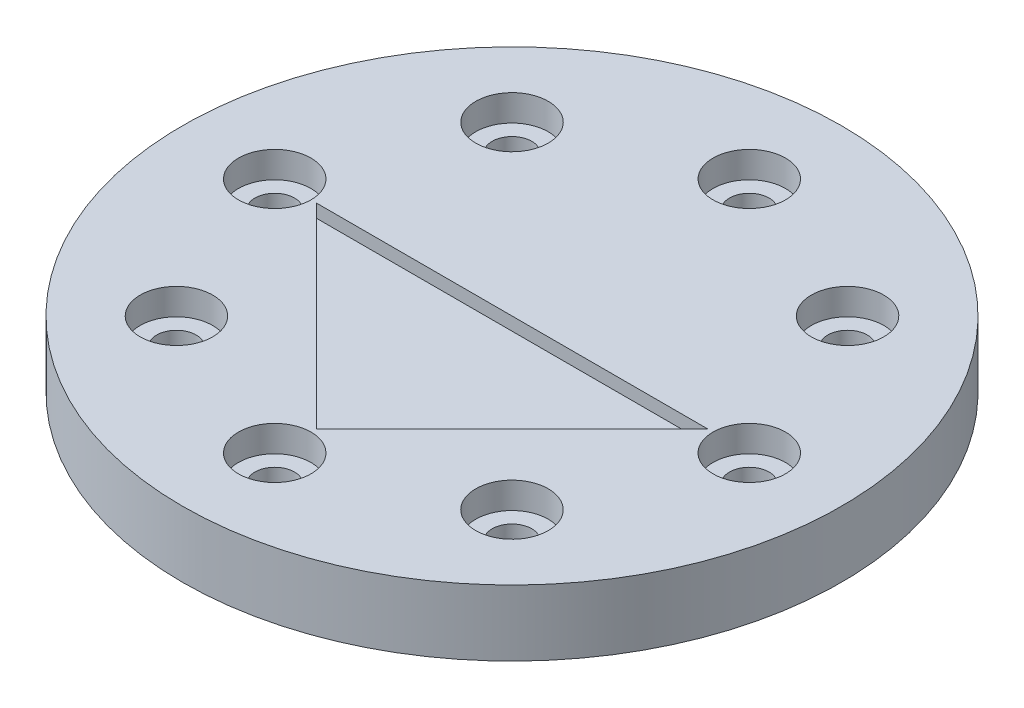
ISO-10303-21;
HEADER;
FILE_DESCRIPTION(('STEP AP214'),'2;1');
FILE_NAME('part.step','',(''),(''),'','','');
FILE_SCHEMA(('AUTOMOTIVE_DESIGN { 1 0 10303 214 1 1 1 1 }'));
ENDSEC;
DATA;
#1=APPLICATION_CONTEXT('core data for automotive mechanical design processes');
#2=APPLICATION_PROTOCOL_DEFINITION('international standard','automotive_design',2000,#1);
#3=PRODUCT_CONTEXT('',#1,'mechanical');
#4=PRODUCT('Part','Part','',(#3));
#5=PRODUCT_RELATED_PRODUCT_CATEGORY('part','',(#4));
#6=PRODUCT_DEFINITION_FORMATION('','',#4);
#7=PRODUCT_DEFINITION_CONTEXT('part definition',#1,'design');
#8=PRODUCT_DEFINITION('design','',#6,#7);
#9=PRODUCT_DEFINITION_SHAPE('','',#8);
#10=(LENGTH_UNIT() NAMED_UNIT(*) SI_UNIT(.MILLI.,.METRE.));
#11=(NAMED_UNIT(*) PLANE_ANGLE_UNIT() SI_UNIT($,.RADIAN.));
#12=(NAMED_UNIT(*) SI_UNIT($,.STERADIAN.) SOLID_ANGLE_UNIT());
#13=UNCERTAINTY_MEASURE_WITH_UNIT(LENGTH_MEASURE(1.E-05),#10,'distance_accuracy_value','');
#14=(GEOMETRIC_REPRESENTATION_CONTEXT(3) GLOBAL_UNCERTAINTY_ASSIGNED_CONTEXT((#13)) GLOBAL_UNIT_ASSIGNED_CONTEXT((#10,
#11,#12)) REPRESENTATION_CONTEXT('',''));
#15=CARTESIAN_POINT('',(0.,0.,0.));
#16=DIRECTION('',(0.,0.,1.));
#17=DIRECTION('',(1.,0.,0.));
#18=AXIS2_PLACEMENT_3D('',#15,#16,#17);
#19=CARTESIAN_POINT('',(0.,3.,0.));
#20=DIRECTION('',(0.,1.,0.));
#21=DIRECTION('',(0.,0.,1.));
#22=AXIS2_PLACEMENT_3D('',#19,#20,#21);
#23=PLANE('',#22);
#24=CARTESIAN_POINT('',(1.88539992297529E-13,3.,-18.));
#25=DIRECTION('',(0.,1.,0.));
#26=DIRECTION('',(1.,0.,0.));
#27=AXIS2_PLACEMENT_3D('',#24,#25,#26);
#28=CIRCLE('',#27,2.75);
#29=CARTESIAN_POINT('',(2.75000000000019,3.,-18.));
#30=VERTEX_POINT('',#29);
#31=EDGE_CURVE('E179',#30,#30,#28,.T.);
#32=ORIENTED_EDGE('',*,*,#31,.F.);
#33=EDGE_LOOP('',(#32));
#34=FACE_BOUND('',#33,.T.);
#35=CARTESIAN_POINT('',(-18.,3.,0.));
#36=DIRECTION('',(0.,1.,0.));
#37=DIRECTION('',(0.,0.,-1.));
#38=AXIS2_PLACEMENT_3D('',#35,#36,#37);
#39=CIRCLE('',#38,2.75);
#40=CARTESIAN_POINT('',(-18.,3.,-2.75));
#41=VERTEX_POINT('',#40);
#42=EDGE_CURVE('E161',#41,#41,#39,.T.);
#43=ORIENTED_EDGE('',*,*,#42,.F.);
#44=EDGE_LOOP('',(#43));
#45=FACE_BOUND('',#44,.T.);
#46=CARTESIAN_POINT('',(0.,3.,18.));
#47=DIRECTION('',(0.,1.,0.));
#48=DIRECTION('',(-1.,0.,0.));
#49=AXIS2_PLACEMENT_3D('',#46,#47,#48);
#50=CIRCLE('',#49,2.75);
#51=CARTESIAN_POINT('',(-2.75000000000006,3.,18.));
#52=VERTEX_POINT('',#51);
#53=EDGE_CURVE('E143',#52,#52,#50,.T.);
#54=ORIENTED_EDGE('',*,*,#53,.F.);
#55=EDGE_LOOP('',(#54));
#56=FACE_BOUND('',#55,.T.);
#57=CARTESIAN_POINT('',(18.,3.,0.));
#58=DIRECTION('',(0.,1.,0.));
#59=DIRECTION('',(0.,0.,1.));
#60=AXIS2_PLACEMENT_3D('',#57,#58,#59);
#61=CIRCLE('',#60,2.75);
#62=CARTESIAN_POINT('',(18.,3.,2.75));
#63=VERTEX_POINT('',#62);
#64=EDGE_CURVE('E125',#63,#63,#61,.T.);
#65=ORIENTED_EDGE('',*,*,#64,.F.);
#66=EDGE_LOOP('',(#65));
#67=FACE_BOUND('',#66,.T.);
#68=CARTESIAN_POINT('',(0.,3.,0.));
#69=DIRECTION('',(0.,1.,0.));
#70=DIRECTION('',(0.,0.,1.));
#71=AXIS2_PLACEMENT_3D('',#68,#69,#70);
#72=CIRCLE('',#71,25.);
#73=CARTESIAN_POINT('',(0.,3.,25.));
#74=VERTEX_POINT('',#73);
#75=EDGE_CURVE('E114',#74,#74,#72,.T.);
#76=ORIENTED_EDGE('',*,*,#75,.T.);
#77=EDGE_LOOP('',(#76));
#78=FACE_BOUND('',#77,.T.);
#79=DIRECTION('',(0.707106781186546,0.,-0.707106781186549));
#80=VECTOR('',#79,1.);
#81=CARTESIAN_POINT('',(14.8492424049176,3.,0.));
#82=LINE('',#81,#80);
#83=CARTESIAN_POINT('',(0.,3.,14.8492424049177));
#84=VERTEX_POINT('',#83);
#85=CARTESIAN_POINT('',(14.8492424049176,3.,0.));
#86=VERTEX_POINT('',#85);
#87=EDGE_CURVE('E119',#84,#86,#82,.T.);
#88=ORIENTED_EDGE('',*,*,#87,.F.);
#89=DIRECTION('',(0.707106781186546,0.,0.707106781186549));
#90=VECTOR('',#89,1.);
#91=CARTESIAN_POINT('',(0.,3.,14.8492424049177));
#92=LINE('',#91,#90);
#93=CARTESIAN_POINT('',(-14.8492424049176,3.,0.));
#94=VERTEX_POINT('',#93);
#95=EDGE_CURVE('E84',#94,#84,#92,.T.);
#96=ORIENTED_EDGE('',*,*,#95,.F.);
#97=DIRECTION('',(-1.,0.,0.));
#98=VECTOR('',#97,1.);
#99=CARTESIAN_POINT('',(-14.8492424049176,3.,0.));
#100=LINE('',#99,#98);
#101=EDGE_CURVE('E117',#86,#94,#100,.T.);
#102=ORIENTED_EDGE('',*,*,#101,.F.);
#103=EDGE_LOOP('',(#88,#96,#102));
#104=FACE_BOUND('',#103,.T.);
#105=CARTESIAN_POINT('',(12.7279220613578,3.,12.7279220613579));
#106=DIRECTION('',(0.,1.,0.));
#107=DIRECTION('',(-0.707106781186549,0.,0.707106781186546));
#108=AXIS2_PLACEMENT_3D('',#105,#106,#107);
#109=CIRCLE('',#108,2.75);
#110=CARTESIAN_POINT('',(10.7833784130948,3.,14.6724657096209));
#111=VERTEX_POINT('',#110);
#112=EDGE_CURVE('E134',#111,#111,#109,.T.);
#113=ORIENTED_EDGE('',*,*,#112,.F.);
#114=EDGE_LOOP('',(#113));
#115=FACE_BOUND('',#114,.T.);
#116=CARTESIAN_POINT('',(-12.7279220613579,3.,12.7279220613578));
#117=DIRECTION('',(0.,1.,0.));
#118=DIRECTION('',(-0.707106781186544,0.,-0.707106781186551));
#119=AXIS2_PLACEMENT_3D('',#116,#117,#118);
#120=CIRCLE('',#119,2.75);
#121=CARTESIAN_POINT('',(-14.6724657096209,3.,10.7833784130948));
#122=VERTEX_POINT('',#121);
#123=EDGE_CURVE('E152',#122,#122,#120,.T.);
#124=ORIENTED_EDGE('',*,*,#123,.F.);
#125=EDGE_LOOP('',(#124));
#126=FACE_BOUND('',#125,.T.);
#127=CARTESIAN_POINT('',(-12.7279220613577,3.,-12.727922061358));
#128=DIRECTION('',(0.,1.,0.));
#129=DIRECTION('',(0.707106781186554,0.,-0.707106781186541));
#130=AXIS2_PLACEMENT_3D('',#127,#128,#129);
#131=CIRCLE('',#130,2.75);
#132=CARTESIAN_POINT('',(-10.7833784130947,3.,-14.672465709621));
#133=VERTEX_POINT('',#132);
#134=EDGE_CURVE('E170',#133,#133,#131,.T.);
#135=ORIENTED_EDGE('',*,*,#134,.F.);
#136=EDGE_LOOP('',(#135));
#137=FACE_BOUND('',#136,.T.);
#138=CARTESIAN_POINT('',(12.727922061358,3.,-12.7279220613577));
#139=DIRECTION('',(0.,1.,0.));
#140=DIRECTION('',(0.707106781186539,0.,0.707106781186556));
#141=AXIS2_PLACEMENT_3D('',#138,#139,#140);
#142=CIRCLE('',#141,2.75);
#143=CARTESIAN_POINT('',(14.672465709621,3.,-10.7833784130947));
#144=VERTEX_POINT('',#143);
#145=EDGE_CURVE('E188',#144,#144,#142,.T.);
#146=ORIENTED_EDGE('',*,*,#145,.F.);
#147=EDGE_LOOP('',(#146));
#148=FACE_BOUND('',#147,.T.);
#149=ADVANCED_FACE('F37',(#34,#45,#56,#67,#78,#104,#115,#126,#137,#148),#23,.T.);
#150=CARTESIAN_POINT('',(0.,1.,0.));
#151=DIRECTION('',(0.,-1.,0.));
#152=DIRECTION('',(0.,0.,-1.));
#153=AXIS2_PLACEMENT_3D('',#150,#151,#152);
#154=CYLINDRICAL_SURFACE('',#153,25.);
#155=CARTESIAN_POINT('',(0.,-2.,0.));
#156=DIRECTION('',(0.,-1.,0.));
#157=DIRECTION('',(0.,0.,-1.));
#158=AXIS2_PLACEMENT_3D('',#155,#156,#157);
#159=CIRCLE('',#158,25.);
#160=CARTESIAN_POINT('',(0.,-2.,-25.));
#161=VERTEX_POINT('',#160);
#162=EDGE_CURVE('E86',#161,#161,#159,.T.);
#163=ORIENTED_EDGE('',*,*,#162,.F.);
#164=EDGE_LOOP('',(#163));
#165=FACE_BOUND('',#164,.T.);
#166=ORIENTED_EDGE('',*,*,#75,.F.);
#167=EDGE_LOOP('',(#166));
#168=FACE_BOUND('',#167,.T.);
#169=ADVANCED_FACE('F39',(#165,#168),#154,.T.);
#170=CARTESIAN_POINT('',(18.,0.,0.));
#171=DIRECTION('',(0.,1.,0.));
#172=DIRECTION('',(0.,0.,1.));
#173=AXIS2_PLACEMENT_3D('',#170,#171,#172);
#174=CYLINDRICAL_SURFACE('',#173,1.5);
#175=CARTESIAN_POINT('',(18.,1.,0.));
#176=DIRECTION('',(0.,1.,0.));
#177=DIRECTION('',(0.,0.,1.));
#178=AXIS2_PLACEMENT_3D('',#175,#176,#177);
#179=CIRCLE('',#178,1.5);
#180=CARTESIAN_POINT('',(18.,1.,1.5));
#181=VERTEX_POINT('',#180);
#182=EDGE_CURVE('E122',#181,#181,#179,.F.);
#183=ORIENTED_EDGE('',*,*,#182,.F.);
#184=EDGE_LOOP('',(#183));
#185=FACE_BOUND('',#184,.T.);
#186=CARTESIAN_POINT('',(18.,-2.,0.));
#187=DIRECTION('',(0.,1.,0.));
#188=DIRECTION('',(0.,0.,1.));
#189=AXIS2_PLACEMENT_3D('',#186,#187,#188);
#190=CIRCLE('',#189,1.5);
#191=CARTESIAN_POINT('',(18.,-2.,1.5));
#192=VERTEX_POINT('',#191);
#193=EDGE_CURVE('E90',#192,#192,#190,.T.);
#194=ORIENTED_EDGE('',*,*,#193,.F.);
#195=EDGE_LOOP('',(#194));
#196=FACE_BOUND('',#195,.T.);
#197=ADVANCED_FACE('F205',(#185,#196),#174,.F.);
#198=CARTESIAN_POINT('',(12.7279220613578,0.,12.7279220613579));
#199=DIRECTION('',(0.,1.,0.));
#200=DIRECTION('',(0.,0.,1.));
#201=AXIS2_PLACEMENT_3D('',#198,#199,#200);
#202=CYLINDRICAL_SURFACE('',#201,1.5);
#203=CARTESIAN_POINT('',(12.7279220613578,1.,12.7279220613579));
#204=DIRECTION('',(0.,1.,0.));
#205=DIRECTION('',(0.,0.,1.));
#206=AXIS2_PLACEMENT_3D('',#203,#204,#205);
#207=CIRCLE('',#206,1.5);
#208=CARTESIAN_POINT('',(12.7279220613578,1.,14.2279220613579));
#209=VERTEX_POINT('',#208);
#210=EDGE_CURVE('E129',#209,#209,#207,.F.);
#211=ORIENTED_EDGE('',*,*,#210,.F.);
#212=EDGE_LOOP('',(#211));
#213=FACE_BOUND('',#212,.T.);
#214=CARTESIAN_POINT('',(12.7279220613578,-2.,12.7279220613579));
#215=DIRECTION('',(0.,1.,0.));
#216=DIRECTION('',(-0.707106781186549,0.,0.707106781186546));
#217=AXIS2_PLACEMENT_3D('',#214,#215,#216);
#218=CIRCLE('',#217,1.5);
#219=CARTESIAN_POINT('',(11.667261889578,-2.,13.7885822331377));
#220=VERTEX_POINT('',#219);
#221=EDGE_CURVE('E93',#220,#220,#218,.T.);
#222=ORIENTED_EDGE('',*,*,#221,.F.);
#223=EDGE_LOOP('',(#222));
#224=FACE_BOUND('',#223,.T.);
#225=ADVANCED_FACE('F248',(#213,#224),#202,.F.);
#226=CARTESIAN_POINT('',(0.,0.,18.));
#227=DIRECTION('',(0.,1.,0.));
#228=DIRECTION('',(0.,0.,1.));
#229=AXIS2_PLACEMENT_3D('',#226,#227,#228);
#230=CYLINDRICAL_SURFACE('',#229,1.5);
#231=CARTESIAN_POINT('',(0.,1.,18.));
#232=DIRECTION('',(0.,1.,0.));
#233=DIRECTION('',(0.,0.,1.));
#234=AXIS2_PLACEMENT_3D('',#231,#232,#233);
#235=CIRCLE('',#234,1.5);
#236=CARTESIAN_POINT('',(0.,1.,19.5));
#237=VERTEX_POINT('',#236);
#238=EDGE_CURVE('E138',#237,#237,#235,.F.);
#239=ORIENTED_EDGE('',*,*,#238,.F.);
#240=EDGE_LOOP('',(#239));
#241=FACE_BOUND('',#240,.T.);
#242=CARTESIAN_POINT('',(0.,-2.,18.));
#243=DIRECTION('',(0.,1.,0.));
#244=DIRECTION('',(-1.,0.,0.));
#245=AXIS2_PLACEMENT_3D('',#242,#243,#244);
#246=CIRCLE('',#245,1.5);
#247=CARTESIAN_POINT('',(-1.50000000000006,-2.,18.));
#248=VERTEX_POINT('',#247);
#249=EDGE_CURVE('E96',#248,#248,#246,.T.);
#250=ORIENTED_EDGE('',*,*,#249,.F.);
#251=EDGE_LOOP('',(#250));
#252=FACE_BOUND('',#251,.T.);
#253=ADVANCED_FACE('F244',(#241,#252),#230,.F.);
#254=CARTESIAN_POINT('',(-12.7279220613579,0.,12.7279220613578));
#255=DIRECTION('',(0.,1.,0.));
#256=DIRECTION('',(0.,0.,1.));
#257=AXIS2_PLACEMENT_3D('',#254,#255,#256);
#258=CYLINDRICAL_SURFACE('',#257,1.5);
#259=CARTESIAN_POINT('',(-12.7279220613579,1.,12.7279220613578));
#260=DIRECTION('',(0.,1.,0.));
#261=DIRECTION('',(0.,0.,1.));
#262=AXIS2_PLACEMENT_3D('',#259,#260,#261);
#263=CIRCLE('',#262,1.5);
#264=CARTESIAN_POINT('',(-12.7279220613579,1.,14.2279220613578));
#265=VERTEX_POINT('',#264);
#266=EDGE_CURVE('E147',#265,#265,#263,.F.);
#267=ORIENTED_EDGE('',*,*,#266,.F.);
#268=EDGE_LOOP('',(#267));
#269=FACE_BOUND('',#268,.T.);
#270=CARTESIAN_POINT('',(-12.7279220613579,-2.,12.7279220613578));
#271=DIRECTION('',(0.,1.,0.));
#272=DIRECTION('',(-0.707106781186544,0.,-0.707106781186551));
#273=AXIS2_PLACEMENT_3D('',#270,#271,#272);
#274=CIRCLE('',#273,1.5);
#275=CARTESIAN_POINT('',(-13.7885822331377,-2.,11.667261889578));
#276=VERTEX_POINT('',#275);
#277=EDGE_CURVE('E99',#276,#276,#274,.T.);
#278=ORIENTED_EDGE('',*,*,#277,.F.);
#279=EDGE_LOOP('',(#278));
#280=FACE_BOUND('',#279,.T.);
#281=ADVANCED_FACE('F240',(#269,#280),#258,.F.);
#282=CARTESIAN_POINT('',(-18.,0.,0.));
#283=DIRECTION('',(0.,1.,0.));
#284=DIRECTION('',(0.,0.,1.));
#285=AXIS2_PLACEMENT_3D('',#282,#283,#284);
#286=CYLINDRICAL_SURFACE('',#285,1.5);
#287=CARTESIAN_POINT('',(-18.,1.,0.));
#288=DIRECTION('',(0.,1.,0.));
#289=DIRECTION('',(0.,0.,1.));
#290=AXIS2_PLACEMENT_3D('',#287,#288,#289);
#291=CIRCLE('',#290,1.5);
#292=CARTESIAN_POINT('',(-18.,1.,1.5));
#293=VERTEX_POINT('',#292);
#294=EDGE_CURVE('E156',#293,#293,#291,.F.);
#295=ORIENTED_EDGE('',*,*,#294,.F.);
#296=EDGE_LOOP('',(#295));
#297=FACE_BOUND('',#296,.T.);
#298=CARTESIAN_POINT('',(-18.,-2.,0.));
#299=DIRECTION('',(0.,1.,0.));
#300=DIRECTION('',(0.,0.,-1.));
#301=AXIS2_PLACEMENT_3D('',#298,#299,#300);
#302=CIRCLE('',#301,1.5);
#303=CARTESIAN_POINT('',(-18.,-2.,-1.5));
#304=VERTEX_POINT('',#303);
#305=EDGE_CURVE('E102',#304,#304,#302,.T.);
#306=ORIENTED_EDGE('',*,*,#305,.F.);
#307=EDGE_LOOP('',(#306));
#308=FACE_BOUND('',#307,.T.);
#309=ADVANCED_FACE('F236',(#297,#308),#286,.F.);
#310=CARTESIAN_POINT('',(-12.7279220613577,0.,-12.727922061358));
#311=DIRECTION('',(0.,1.,0.));
#312=DIRECTION('',(0.,0.,1.));
#313=AXIS2_PLACEMENT_3D('',#310,#311,#312);
#314=CYLINDRICAL_SURFACE('',#313,1.5);
#315=CARTESIAN_POINT('',(-12.7279220613577,1.,-12.727922061358));
#316=DIRECTION('',(0.,1.,0.));
#317=DIRECTION('',(0.,0.,1.));
#318=AXIS2_PLACEMENT_3D('',#315,#316,#317);
#319=CIRCLE('',#318,1.5);
#320=CARTESIAN_POINT('',(-12.7279220613577,1.,-11.227922061358));
#321=VERTEX_POINT('',#320);
#322=EDGE_CURVE('E165',#321,#321,#319,.F.);
#323=ORIENTED_EDGE('',*,*,#322,.F.);
#324=EDGE_LOOP('',(#323));
#325=FACE_BOUND('',#324,.T.);
#326=CARTESIAN_POINT('',(-12.7279220613577,-2.,-12.727922061358));
#327=DIRECTION('',(0.,1.,0.));
#328=DIRECTION('',(0.707106781186554,0.,-0.707106781186541));
#329=AXIS2_PLACEMENT_3D('',#326,#327,#328);
#330=CIRCLE('',#329,1.5);
#331=CARTESIAN_POINT('',(-11.6672618895779,-2.,-13.7885822331378));
#332=VERTEX_POINT('',#331);
#333=EDGE_CURVE('E105',#332,#332,#330,.T.);
#334=ORIENTED_EDGE('',*,*,#333,.F.);
#335=EDGE_LOOP('',(#334));
#336=FACE_BOUND('',#335,.T.);
#337=ADVANCED_FACE('F232',(#325,#336),#314,.F.);
#338=CARTESIAN_POINT('',(1.88539992297529E-13,0.,-18.));
#339=DIRECTION('',(0.,1.,0.));
#340=DIRECTION('',(0.,0.,1.));
#341=AXIS2_PLACEMENT_3D('',#338,#339,#340);
#342=CYLINDRICAL_SURFACE('',#341,1.5);
#343=CARTESIAN_POINT('',(1.88539992297529E-13,1.,-18.));
#344=DIRECTION('',(0.,1.,0.));
#345=DIRECTION('',(0.,0.,1.));
#346=AXIS2_PLACEMENT_3D('',#343,#344,#345);
#347=CIRCLE('',#346,1.5);
#348=CARTESIAN_POINT('',(1.88539992297529E-13,1.,-16.5));
#349=VERTEX_POINT('',#348);
#350=EDGE_CURVE('E174',#349,#349,#347,.F.);
#351=ORIENTED_EDGE('',*,*,#350,.F.);
#352=EDGE_LOOP('',(#351));
#353=FACE_BOUND('',#352,.T.);
#354=CARTESIAN_POINT('',(1.88539992297529E-13,-2.,-18.));
#355=DIRECTION('',(0.,1.,0.));
#356=DIRECTION('',(1.,0.,0.));
#357=AXIS2_PLACEMENT_3D('',#354,#355,#356);
#358=CIRCLE('',#357,1.5);
#359=CARTESIAN_POINT('',(1.50000000000019,-2.,-18.));
#360=VERTEX_POINT('',#359);
#361=EDGE_CURVE('E108',#360,#360,#358,.T.);
#362=ORIENTED_EDGE('',*,*,#361,.F.);
#363=EDGE_LOOP('',(#362));
#364=FACE_BOUND('',#363,.T.);
#365=ADVANCED_FACE('F228',(#353,#364),#342,.F.);
#366=CARTESIAN_POINT('',(12.727922061358,0.,-12.7279220613577));
#367=DIRECTION('',(0.,1.,0.));
#368=DIRECTION('',(0.,0.,1.));
#369=AXIS2_PLACEMENT_3D('',#366,#367,#368);
#370=CYLINDRICAL_SURFACE('',#369,1.5);
#371=CARTESIAN_POINT('',(12.727922061358,1.,-12.7279220613577));
#372=DIRECTION('',(0.,1.,0.));
#373=DIRECTION('',(0.,0.,1.));
#374=AXIS2_PLACEMENT_3D('',#371,#372,#373);
#375=CIRCLE('',#374,1.5);
#376=CARTESIAN_POINT('',(12.727922061358,1.,-11.2279220613577));
#377=VERTEX_POINT('',#376);
#378=EDGE_CURVE('E183',#377,#377,#375,.F.);
#379=ORIENTED_EDGE('',*,*,#378,.F.);
#380=EDGE_LOOP('',(#379));
#381=FACE_BOUND('',#380,.T.);
#382=CARTESIAN_POINT('',(12.727922061358,-2.,-12.7279220613577));
#383=DIRECTION('',(0.,1.,0.));
#384=DIRECTION('',(0.707106781186539,0.,0.707106781186556));
#385=AXIS2_PLACEMENT_3D('',#382,#383,#384);
#386=CIRCLE('',#385,1.5);
#387=CARTESIAN_POINT('',(13.7885822331378,-2.,-11.6672618895779));
#388=VERTEX_POINT('',#387);
#389=EDGE_CURVE('E111',#388,#388,#386,.T.);
#390=ORIENTED_EDGE('',*,*,#389,.F.);
#391=EDGE_LOOP('',(#390));
#392=FACE_BOUND('',#391,.T.);
#393=ADVANCED_FACE('F216',(#381,#392),#370,.F.);
#394=CARTESIAN_POINT('',(0.,-2.,0.));
#395=DIRECTION('',(0.,-1.,0.));
#396=DIRECTION('',(0.,0.,-1.));
#397=AXIS2_PLACEMENT_3D('',#394,#395,#396);
#398=PLANE('',#397);
#399=ORIENTED_EDGE('',*,*,#389,.T.);
#400=EDGE_LOOP('',(#399));
#401=FACE_BOUND('',#400,.T.);
#402=ORIENTED_EDGE('',*,*,#361,.T.);
#403=EDGE_LOOP('',(#402));
#404=FACE_BOUND('',#403,.T.);
#405=ORIENTED_EDGE('',*,*,#333,.T.);
#406=EDGE_LOOP('',(#405));
#407=FACE_BOUND('',#406,.T.);
#408=ORIENTED_EDGE('',*,*,#305,.T.);
#409=EDGE_LOOP('',(#408));
#410=FACE_BOUND('',#409,.T.);
#411=ORIENTED_EDGE('',*,*,#277,.T.);
#412=EDGE_LOOP('',(#411));
#413=FACE_BOUND('',#412,.T.);
#414=ORIENTED_EDGE('',*,*,#249,.T.);
#415=EDGE_LOOP('',(#414));
#416=FACE_BOUND('',#415,.T.);
#417=ORIENTED_EDGE('',*,*,#221,.T.);
#418=EDGE_LOOP('',(#417));
#419=FACE_BOUND('',#418,.T.);
#420=ORIENTED_EDGE('',*,*,#193,.T.);
#421=EDGE_LOOP('',(#420));
#422=FACE_BOUND('',#421,.T.);
#423=ORIENTED_EDGE('',*,*,#162,.T.);
#424=EDGE_LOOP('',(#423));
#425=FACE_BOUND('',#424,.T.);
#426=ADVANCED_FACE('F213',(#401,#404,#407,#410,#413,#416,#419,#422,#425),#398,.T.);
#427=CARTESIAN_POINT('',(0.,0.,14.8492424049177));
#428=DIRECTION('',(-0.707106781186549,0.,-0.707106781186546));
#429=DIRECTION('',(-0.707106781186546,0.,0.707106781186549));
#430=AXIS2_PLACEMENT_3D('',#427,#428,#429);
#431=PLANE('',#430);
#432=DIRECTION('',(0.707106781186546,0.,-0.707106781186549));
#433=VECTOR('',#432,1.);
#434=CARTESIAN_POINT('',(14.8492424049176,2.,0.));
#435=LINE('',#434,#433);
#436=CARTESIAN_POINT('',(0.,2.,14.8492424049177));
#437=VERTEX_POINT('',#436);
#438=CARTESIAN_POINT('',(14.8492424049176,2.,0.));
#439=VERTEX_POINT('',#438);
#440=EDGE_CURVE('E54',#437,#439,#435,.T.);
#441=ORIENTED_EDGE('',*,*,#440,.F.);
#442=DIRECTION('',(0.,1.,0.));
#443=VECTOR('',#442,1.);
#444=CARTESIAN_POINT('',(0.,0.,14.8492424049177));
#445=LINE('',#444,#443);
#446=EDGE_CURVE('E46',#437,#84,#445,.T.);
#447=ORIENTED_EDGE('',*,*,#446,.T.);
#448=ORIENTED_EDGE('',*,*,#87,.T.);
#449=DIRECTION('',(0.,1.,0.));
#450=VECTOR('',#449,1.);
#451=CARTESIAN_POINT('',(14.8492424049176,0.,0.));
#452=LINE('',#451,#450);
#453=EDGE_CURVE('E41',#439,#86,#452,.T.);
#454=ORIENTED_EDGE('',*,*,#453,.F.);
#455=EDGE_LOOP('',(#441,#447,#448,#454));
#456=FACE_BOUND('',#455,.T.);
#457=ADVANCED_FACE('F79',(#456),#431,.T.);
#458=CARTESIAN_POINT('',(0.,0.,14.8492424049177));
#459=DIRECTION('',(0.707106781186549,0.,-0.707106781186546));
#460=DIRECTION('',(-0.707106781186546,0.,-0.707106781186549));
#461=AXIS2_PLACEMENT_3D('',#458,#459,#460);
#462=PLANE('',#461);
#463=DIRECTION('',(0.707106781186546,0.,0.707106781186549));
#464=VECTOR('',#463,1.);
#465=CARTESIAN_POINT('',(0.,2.,14.8492424049177));
#466=LINE('',#465,#464);
#467=CARTESIAN_POINT('',(-14.8492424049176,2.,0.));
#468=VERTEX_POINT('',#467);
#469=EDGE_CURVE('E71',#468,#437,#466,.T.);
#470=ORIENTED_EDGE('',*,*,#469,.F.);
#471=DIRECTION('',(0.,1.,0.));
#472=VECTOR('',#471,1.);
#473=CARTESIAN_POINT('',(-14.8492424049176,0.,0.));
#474=LINE('',#473,#472);
#475=EDGE_CURVE('E11',#468,#94,#474,.T.);
#476=ORIENTED_EDGE('',*,*,#475,.T.);
#477=ORIENTED_EDGE('',*,*,#95,.T.);
#478=ORIENTED_EDGE('',*,*,#446,.F.);
#479=EDGE_LOOP('',(#470,#476,#477,#478));
#480=FACE_BOUND('',#479,.T.);
#481=ADVANCED_FACE('F82',(#480),#462,.T.);
#482=CARTESIAN_POINT('',(-15.2027957955108,0.,0.));
#483=DIRECTION('',(0.,0.,-1.));
#484=DIRECTION('',(-1.,0.,0.));
#485=AXIS2_PLACEMENT_3D('',#482,#483,#484);
#486=PLANE('',#485);
#487=ORIENTED_EDGE('',*,*,#475,.F.);
#488=DIRECTION('',(-1.,0.,0.));
#489=VECTOR('',#488,1.);
#490=CARTESIAN_POINT('',(-14.8492424049176,2.,0.));
#491=LINE('',#490,#489);
#492=EDGE_CURVE('E73',#439,#468,#491,.T.);
#493=ORIENTED_EDGE('',*,*,#492,.F.);
#494=ORIENTED_EDGE('',*,*,#453,.T.);
#495=ORIENTED_EDGE('',*,*,#101,.T.);
#496=EDGE_LOOP('',(#487,#493,#494,#495));
#497=FACE_BOUND('',#496,.T.);
#498=ADVANCED_FACE('F220',(#497),#486,.F.);
#499=CARTESIAN_POINT('',(18.,1.,0.));
#500=DIRECTION('',(0.,1.,0.));
#501=DIRECTION('',(0.,0.,1.));
#502=AXIS2_PLACEMENT_3D('',#499,#500,#501);
#503=PLANE('',#502);
#504=CARTESIAN_POINT('',(18.,1.,0.));
#505=DIRECTION('',(0.,1.,0.));
#506=DIRECTION('',(0.,0.,1.));
#507=AXIS2_PLACEMENT_3D('',#504,#505,#506);
#508=CIRCLE('',#507,2.75);
#509=CARTESIAN_POINT('',(18.,1.,2.75));
#510=VERTEX_POINT('',#509);
#511=EDGE_CURVE('E126',#510,#510,#508,.T.);
#512=ORIENTED_EDGE('',*,*,#511,.T.);
#513=EDGE_LOOP('',(#512));
#514=FACE_BOUND('',#513,.T.);
#515=ORIENTED_EDGE('',*,*,#182,.T.);
#516=EDGE_LOOP('',(#515));
#517=FACE_BOUND('',#516,.T.);
#518=ADVANCED_FACE('F225',(#514,#517),#503,.T.);
#519=CARTESIAN_POINT('',(18.,3.,0.));
#520=DIRECTION('',(0.,-1.,0.));
#521=DIRECTION('',(0.,0.,-1.));
#522=AXIS2_PLACEMENT_3D('',#519,#520,#521);
#523=CYLINDRICAL_SURFACE('',#522,2.75);
#524=ORIENTED_EDGE('',*,*,#64,.T.);
#525=EDGE_LOOP('',(#524));
#526=FACE_BOUND('',#525,.T.);
#527=ORIENTED_EDGE('',*,*,#511,.F.);
#528=EDGE_LOOP('',(#527));
#529=FACE_BOUND('',#528,.T.);
#530=ADVANCED_FACE('F211',(#526,#529),#523,.F.);
#531=CARTESIAN_POINT('',(12.7279220613578,1.,12.7279220613579));
#532=DIRECTION('',(0.,1.,0.));
#533=DIRECTION('',(-0.707106781186549,0.,0.707106781186546));
#534=AXIS2_PLACEMENT_3D('',#531,#532,#533);
#535=PLANE('',#534);
#536=CARTESIAN_POINT('',(12.7279220613578,1.,12.7279220613579));
#537=DIRECTION('',(0.,1.,0.));
#538=DIRECTION('',(-0.707106781186549,0.,0.707106781186546));
#539=AXIS2_PLACEMENT_3D('',#536,#537,#538);
#540=CIRCLE('',#539,2.75);
#541=CARTESIAN_POINT('',(10.7833784130948,1.,14.6724657096209));
#542=VERTEX_POINT('',#541);
#543=EDGE_CURVE('E135',#542,#542,#540,.T.);
#544=ORIENTED_EDGE('',*,*,#543,.T.);
#545=EDGE_LOOP('',(#544));
#546=FACE_BOUND('',#545,.T.);
#547=ORIENTED_EDGE('',*,*,#210,.T.);
#548=EDGE_LOOP('',(#547));
#549=FACE_BOUND('',#548,.T.);
#550=ADVANCED_FACE('F332',(#546,#549),#535,.T.);
#551=CARTESIAN_POINT('',(12.7279220613578,3.,12.7279220613579));
#552=DIRECTION('',(0.,-1.,0.));
#553=DIRECTION('',(0.,0.,-1.));
#554=AXIS2_PLACEMENT_3D('',#551,#552,#553);
#555=CYLINDRICAL_SURFACE('',#554,2.75);
#556=ORIENTED_EDGE('',*,*,#112,.T.);
#557=EDGE_LOOP('',(#556));
#558=FACE_BOUND('',#557,.T.);
#559=ORIENTED_EDGE('',*,*,#543,.F.);
#560=EDGE_LOOP('',(#559));
#561=FACE_BOUND('',#560,.T.);
#562=ADVANCED_FACE('F327',(#558,#561),#555,.F.);
#563=CARTESIAN_POINT('',(0.,1.,18.));
#564=DIRECTION('',(0.,1.,0.));
#565=DIRECTION('',(-1.,0.,0.));
#566=AXIS2_PLACEMENT_3D('',#563,#564,#565);
#567=PLANE('',#566);
#568=CARTESIAN_POINT('',(0.,1.,18.));
#569=DIRECTION('',(0.,1.,0.));
#570=DIRECTION('',(-1.,0.,0.));
#571=AXIS2_PLACEMENT_3D('',#568,#569,#570);
#572=CIRCLE('',#571,2.75);
#573=CARTESIAN_POINT('',(-2.75000000000006,1.,18.));
#574=VERTEX_POINT('',#573);
#575=EDGE_CURVE('E144',#574,#574,#572,.T.);
#576=ORIENTED_EDGE('',*,*,#575,.T.);
#577=EDGE_LOOP('',(#576));
#578=FACE_BOUND('',#577,.T.);
#579=ORIENTED_EDGE('',*,*,#238,.T.);
#580=EDGE_LOOP('',(#579));
#581=FACE_BOUND('',#580,.T.);
#582=ADVANCED_FACE('F324',(#578,#581),#567,.T.);
#583=CARTESIAN_POINT('',(0.,3.,18.));
#584=DIRECTION('',(0.,-1.,0.));
#585=DIRECTION('',(0.,0.,-1.));
#586=AXIS2_PLACEMENT_3D('',#583,#584,#585);
#587=CYLINDRICAL_SURFACE('',#586,2.75);
#588=ORIENTED_EDGE('',*,*,#53,.T.);
#589=EDGE_LOOP('',(#588));
#590=FACE_BOUND('',#589,.T.);
#591=ORIENTED_EDGE('',*,*,#575,.F.);
#592=EDGE_LOOP('',(#591));
#593=FACE_BOUND('',#592,.T.);
#594=ADVANCED_FACE('F319',(#590,#593),#587,.F.);
#595=CARTESIAN_POINT('',(-12.7279220613579,1.,12.7279220613578));
#596=DIRECTION('',(0.,1.,0.));
#597=DIRECTION('',(-0.707106781186544,0.,-0.707106781186551));
#598=AXIS2_PLACEMENT_3D('',#595,#596,#597);
#599=PLANE('',#598);
#600=CARTESIAN_POINT('',(-12.7279220613579,1.,12.7279220613578));
#601=DIRECTION('',(0.,1.,0.));
#602=DIRECTION('',(-0.707106781186544,0.,-0.707106781186551));
#603=AXIS2_PLACEMENT_3D('',#600,#601,#602);
#604=CIRCLE('',#603,2.75);
#605=CARTESIAN_POINT('',(-14.6724657096209,1.,10.7833784130948));
#606=VERTEX_POINT('',#605);
#607=EDGE_CURVE('E153',#606,#606,#604,.T.);
#608=ORIENTED_EDGE('',*,*,#607,.T.);
#609=EDGE_LOOP('',(#608));
#610=FACE_BOUND('',#609,.T.);
#611=ORIENTED_EDGE('',*,*,#266,.T.);
#612=EDGE_LOOP('',(#611));
#613=FACE_BOUND('',#612,.T.);
#614=ADVANCED_FACE('F316',(#610,#613),#599,.T.);
#615=CARTESIAN_POINT('',(-12.7279220613579,3.,12.7279220613578));
#616=DIRECTION('',(0.,-1.,0.));
#617=DIRECTION('',(0.,0.,-1.));
#618=AXIS2_PLACEMENT_3D('',#615,#616,#617);
#619=CYLINDRICAL_SURFACE('',#618,2.75);
#620=ORIENTED_EDGE('',*,*,#123,.T.);
#621=EDGE_LOOP('',(#620));
#622=FACE_BOUND('',#621,.T.);
#623=ORIENTED_EDGE('',*,*,#607,.F.);
#624=EDGE_LOOP('',(#623));
#625=FACE_BOUND('',#624,.T.);
#626=ADVANCED_FACE('F313',(#622,#625),#619,.F.);
#627=CARTESIAN_POINT('',(-18.,1.,0.));
#628=DIRECTION('',(0.,1.,0.));
#629=DIRECTION('',(0.,0.,-1.));
#630=AXIS2_PLACEMENT_3D('',#627,#628,#629);
#631=PLANE('',#630);
#632=CARTESIAN_POINT('',(-18.,1.,0.));
#633=DIRECTION('',(0.,1.,0.));
#634=DIRECTION('',(0.,0.,-1.));
#635=AXIS2_PLACEMENT_3D('',#632,#633,#634);
#636=CIRCLE('',#635,2.75);
#637=CARTESIAN_POINT('',(-18.,1.,-2.75));
#638=VERTEX_POINT('',#637);
#639=EDGE_CURVE('E162',#638,#638,#636,.T.);
#640=ORIENTED_EDGE('',*,*,#639,.T.);
#641=EDGE_LOOP('',(#640));
#642=FACE_BOUND('',#641,.T.);
#643=ORIENTED_EDGE('',*,*,#294,.T.);
#644=EDGE_LOOP('',(#643));
#645=FACE_BOUND('',#644,.T.);
#646=ADVANCED_FACE('F305',(#642,#645),#631,.T.);
#647=CARTESIAN_POINT('',(-18.,3.,0.));
#648=DIRECTION('',(0.,-1.,0.));
#649=DIRECTION('',(0.,0.,-1.));
#650=AXIS2_PLACEMENT_3D('',#647,#648,#649);
#651=CYLINDRICAL_SURFACE('',#650,2.75);
#652=ORIENTED_EDGE('',*,*,#42,.T.);
#653=EDGE_LOOP('',(#652));
#654=FACE_BOUND('',#653,.T.);
#655=ORIENTED_EDGE('',*,*,#639,.F.);
#656=EDGE_LOOP('',(#655));
#657=FACE_BOUND('',#656,.T.);
#658=ADVANCED_FACE('F284',(#654,#657),#651,.F.);
#659=CARTESIAN_POINT('',(-12.7279220613577,1.,-12.727922061358));
#660=DIRECTION('',(0.,1.,0.));
#661=DIRECTION('',(0.707106781186554,0.,-0.707106781186541));
#662=AXIS2_PLACEMENT_3D('',#659,#660,#661);
#663=PLANE('',#662);
#664=CARTESIAN_POINT('',(-12.7279220613577,1.,-12.727922061358));
#665=DIRECTION('',(0.,1.,0.));
#666=DIRECTION('',(0.707106781186554,0.,-0.707106781186541));
#667=AXIS2_PLACEMENT_3D('',#664,#665,#666);
#668=CIRCLE('',#667,2.75);
#669=CARTESIAN_POINT('',(-10.7833784130947,1.,-14.672465709621));
#670=VERTEX_POINT('',#669);
#671=EDGE_CURVE('E171',#670,#670,#668,.T.);
#672=ORIENTED_EDGE('',*,*,#671,.T.);
#673=EDGE_LOOP('',(#672));
#674=FACE_BOUND('',#673,.T.);
#675=ORIENTED_EDGE('',*,*,#322,.T.);
#676=EDGE_LOOP('',(#675));
#677=FACE_BOUND('',#676,.T.);
#678=ADVANCED_FACE('F278',(#674,#677),#663,.T.);
#679=CARTESIAN_POINT('',(-12.7279220613577,3.,-12.727922061358));
#680=DIRECTION('',(0.,-1.,0.));
#681=DIRECTION('',(0.,0.,-1.));
#682=AXIS2_PLACEMENT_3D('',#679,#680,#681);
#683=CYLINDRICAL_SURFACE('',#682,2.75);
#684=ORIENTED_EDGE('',*,*,#134,.T.);
#685=EDGE_LOOP('',(#684));
#686=FACE_BOUND('',#685,.T.);
#687=ORIENTED_EDGE('',*,*,#671,.F.);
#688=EDGE_LOOP('',(#687));
#689=FACE_BOUND('',#688,.T.);
#690=ADVANCED_FACE('F274',(#686,#689),#683,.F.);
#691=CARTESIAN_POINT('',(1.88539992297529E-13,1.,-18.));
#692=DIRECTION('',(0.,1.,0.));
#693=DIRECTION('',(1.,0.,0.));
#694=AXIS2_PLACEMENT_3D('',#691,#692,#693);
#695=PLANE('',#694);
#696=CARTESIAN_POINT('',(1.88539992297529E-13,1.,-18.));
#697=DIRECTION('',(0.,1.,0.));
#698=DIRECTION('',(1.,0.,0.));
#699=AXIS2_PLACEMENT_3D('',#696,#697,#698);
#700=CIRCLE('',#699,2.75);
#701=CARTESIAN_POINT('',(2.75000000000019,1.,-18.));
#702=VERTEX_POINT('',#701);
#703=EDGE_CURVE('E180',#702,#702,#700,.T.);
#704=ORIENTED_EDGE('',*,*,#703,.T.);
#705=EDGE_LOOP('',(#704));
#706=FACE_BOUND('',#705,.T.);
#707=ORIENTED_EDGE('',*,*,#350,.T.);
#708=EDGE_LOOP('',(#707));
#709=FACE_BOUND('',#708,.T.);
#710=ADVANCED_FACE('F277',(#706,#709),#695,.T.);
#711=CARTESIAN_POINT('',(1.88539992297529E-13,3.,-18.));
#712=DIRECTION('',(0.,-1.,0.));
#713=DIRECTION('',(0.,0.,-1.));
#714=AXIS2_PLACEMENT_3D('',#711,#712,#713);
#715=CYLINDRICAL_SURFACE('',#714,2.75);
#716=ORIENTED_EDGE('',*,*,#31,.T.);
#717=EDGE_LOOP('',(#716));
#718=FACE_BOUND('',#717,.T.);
#719=ORIENTED_EDGE('',*,*,#703,.F.);
#720=EDGE_LOOP('',(#719));
#721=FACE_BOUND('',#720,.T.);
#722=ADVANCED_FACE('F309',(#718,#721),#715,.F.);
#723=CARTESIAN_POINT('',(12.727922061358,1.,-12.7279220613577));
#724=DIRECTION('',(0.,1.,0.));
#725=DIRECTION('',(0.707106781186539,0.,0.707106781186556));
#726=AXIS2_PLACEMENT_3D('',#723,#724,#725);
#727=PLANE('',#726);
#728=CARTESIAN_POINT('',(12.727922061358,1.,-12.7279220613577));
#729=DIRECTION('',(0.,1.,0.));
#730=DIRECTION('',(0.707106781186539,0.,0.707106781186556));
#731=AXIS2_PLACEMENT_3D('',#728,#729,#730);
#732=CIRCLE('',#731,2.75);
#733=CARTESIAN_POINT('',(14.672465709621,1.,-10.7833784130947));
#734=VERTEX_POINT('',#733);
#735=EDGE_CURVE('E189',#734,#734,#732,.T.);
#736=ORIENTED_EDGE('',*,*,#735,.T.);
#737=EDGE_LOOP('',(#736));
#738=FACE_BOUND('',#737,.T.);
#739=ORIENTED_EDGE('',*,*,#378,.T.);
#740=EDGE_LOOP('',(#739));
#741=FACE_BOUND('',#740,.T.);
#742=ADVANCED_FACE('F410',(#738,#741),#727,.T.);
#743=CARTESIAN_POINT('',(12.727922061358,3.,-12.7279220613577));
#744=DIRECTION('',(0.,-1.,0.));
#745=DIRECTION('',(0.,0.,-1.));
#746=AXIS2_PLACEMENT_3D('',#743,#744,#745);
#747=CYLINDRICAL_SURFACE('',#746,2.75);
#748=ORIENTED_EDGE('',*,*,#145,.T.);
#749=EDGE_LOOP('',(#748));
#750=FACE_BOUND('',#749,.T.);
#751=ORIENTED_EDGE('',*,*,#735,.F.);
#752=EDGE_LOOP('',(#751));
#753=FACE_BOUND('',#752,.T.);
#754=ADVANCED_FACE('F196',(#750,#753),#747,.F.);
#755=CARTESIAN_POINT('',(0.,2.,0.));
#756=DIRECTION('',(0.,1.,0.));
#757=DIRECTION('',(0.,0.,1.));
#758=AXIS2_PLACEMENT_3D('',#755,#756,#757);
#759=PLANE('',#758);
#760=ORIENTED_EDGE('',*,*,#469,.T.);
#761=ORIENTED_EDGE('',*,*,#440,.T.);
#762=ORIENTED_EDGE('',*,*,#492,.T.);
#763=EDGE_LOOP('',(#760,#761,#762));
#764=FACE_BOUND('',#763,.T.);
#765=ADVANCED_FACE('F72',(#764),#759,.T.);
#766=CLOSED_SHELL('',(#149,#169,#197,#225,#253,#281,#309,#337,#365,#393,#426,#457,#481,#498,
#518,#530,#550,#562,#582,#594,#614,#626,#646,#658,#678,#690,#710,#722,#742,#754,#765));
#767=MANIFOLD_SOLID_BREP('B2',#766);
#768=ADVANCED_BREP_SHAPE_REPRESENTATION('',(#18,#767),#14);
#769=SHAPE_DEFINITION_REPRESENTATION(#9,#768);
ENDSEC;
END-ISO-10303-21;
